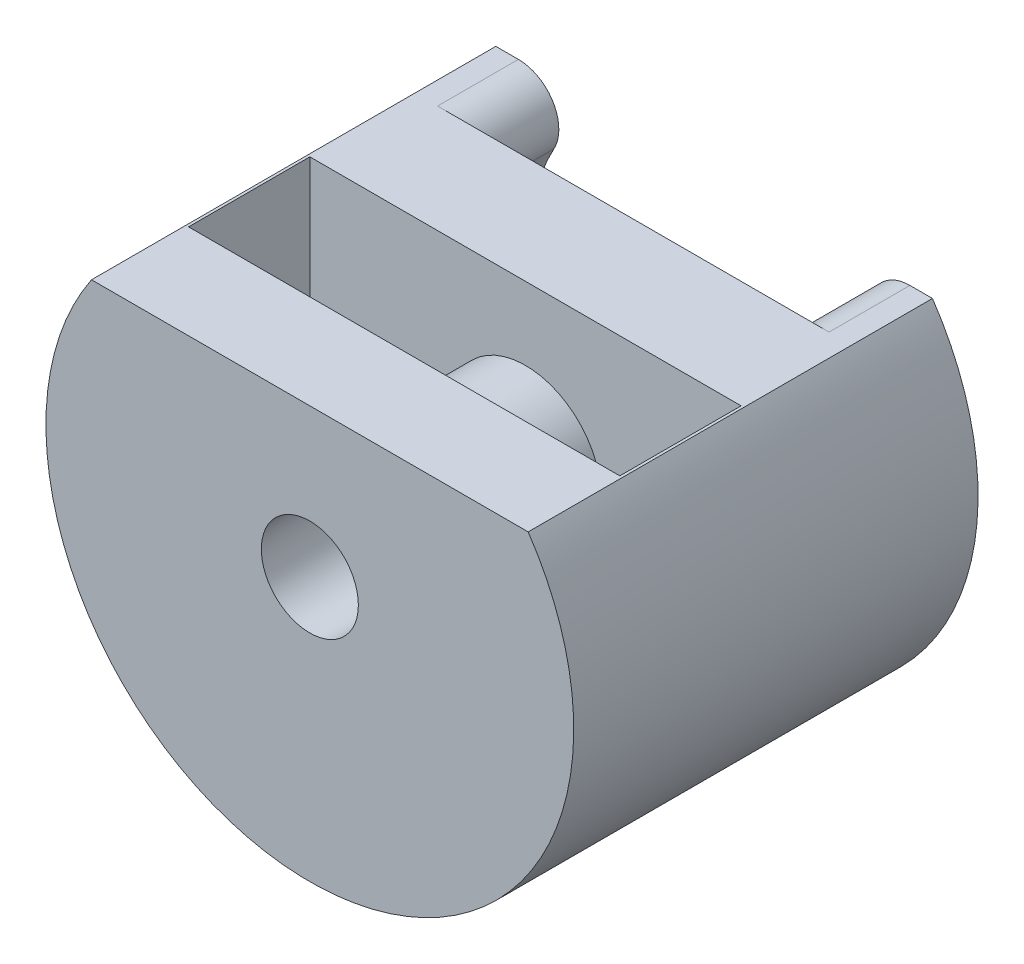
ISO-10303-21;
HEADER;
FILE_DESCRIPTION(('STEP AP214'),'2;1');
FILE_NAME('part.step','',(''),(''),'','','');
FILE_SCHEMA(('AUTOMOTIVE_DESIGN { 1 0 10303 214 1 1 1 1 }'));
ENDSEC;
DATA;
#1=APPLICATION_CONTEXT('core data for automotive mechanical design processes');
#2=APPLICATION_PROTOCOL_DEFINITION('international standard','automotive_design',2000,#1);
#3=PRODUCT_CONTEXT('',#1,'mechanical');
#4=PRODUCT('Part','Part','',(#3));
#5=PRODUCT_RELATED_PRODUCT_CATEGORY('part','',(#4));
#6=PRODUCT_DEFINITION_FORMATION('','',#4);
#7=PRODUCT_DEFINITION_CONTEXT('part definition',#1,'design');
#8=PRODUCT_DEFINITION('design','',#6,#7);
#9=PRODUCT_DEFINITION_SHAPE('','',#8);
#10=(LENGTH_UNIT() NAMED_UNIT(*) SI_UNIT(.MILLI.,.METRE.));
#11=(NAMED_UNIT(*) PLANE_ANGLE_UNIT() SI_UNIT($,.RADIAN.));
#12=(NAMED_UNIT(*) SI_UNIT($,.STERADIAN.) SOLID_ANGLE_UNIT());
#13=UNCERTAINTY_MEASURE_WITH_UNIT(LENGTH_MEASURE(1.E-05),#10,'distance_accuracy_value','');
#14=(GEOMETRIC_REPRESENTATION_CONTEXT(3) GLOBAL_UNCERTAINTY_ASSIGNED_CONTEXT((#13)) GLOBAL_UNIT_ASSIGNED_CONTEXT((#10,
#11,#12)) REPRESENTATION_CONTEXT('',''));
#15=CARTESIAN_POINT('',(0.,0.,0.));
#16=DIRECTION('',(0.,0.,1.));
#17=DIRECTION('',(1.,0.,0.));
#18=AXIS2_PLACEMENT_3D('',#15,#16,#17);
#19=CARTESIAN_POINT('',(16.1,7.10459399028028,8.5));
#20=DIRECTION('',(0.,-1.,0.));
#21=DIRECTION('',(0.,0.,-1.));
#22=AXIS2_PLACEMENT_3D('',#19,#20,#21);
#23=PLANE('',#22);
#24=DIRECTION('',(-1.,0.,0.));
#25=VECTOR('',#24,1.);
#26=CARTESIAN_POINT('',(16.1,7.10459399028028,8.5));
#27=LINE('',#26,#25);
#28=CARTESIAN_POINT('',(5.30195423604308,7.10459399028028,8.5));
#29=VERTEX_POINT('',#28);
#30=CARTESIAN_POINT('',(0.1,7.10459399028028,8.5));
#31=VERTEX_POINT('',#30);
#32=EDGE_CURVE('E152',#29,#31,#27,.T.);
#33=ORIENTED_EDGE('',*,*,#32,.F.);
#34=DIRECTION('',(0.,0.,-1.));
#35=VECTOR('',#34,1.);
#36=CARTESIAN_POINT('',(5.30195423604308,7.10459399028028,19.9195959492893));
#37=LINE('',#36,#35);
#38=CARTESIAN_POINT('',(5.30195423604308,7.10459399028028,9.));
#39=VERTEX_POINT('',#38);
#40=EDGE_CURVE('E139',#29,#39,#37,.F.);
#41=ORIENTED_EDGE('',*,*,#40,.T.);
#42=DIRECTION('',(-1.,0.,0.));
#43=VECTOR('',#42,1.);
#44=CARTESIAN_POINT('',(16.1,7.10459399028028,9.));
#45=LINE('',#44,#43);
#46=CARTESIAN_POINT('',(0.1,7.10459399028028,9.));
#47=VERTEX_POINT('',#46);
#48=EDGE_CURVE('E150',#39,#47,#45,.T.);
#49=ORIENTED_EDGE('',*,*,#48,.T.);
#50=DIRECTION('',(0.,0.,1.));
#51=VECTOR('',#50,1.);
#52=CARTESIAN_POINT('',(0.1,7.10459399028028,8.5));
#53=LINE('',#52,#51);
#54=EDGE_CURVE('E299',#31,#47,#53,.T.);
#55=ORIENTED_EDGE('',*,*,#54,.F.);
#56=EDGE_LOOP('',(#33,#41,#49,#55));
#57=FACE_BOUND('',#56,.T.);
#58=ADVANCED_FACE('F36',(#57),#23,.T.);
#59=CARTESIAN_POINT('',(16.1,12.5,8.5));
#60=DIRECTION('',(0.,0.,-1.));
#61=DIRECTION('',(0.,1.,0.));
#62=AXIS2_PLACEMENT_3D('',#59,#60,#61);
#63=PLANE('',#62);
#64=CARTESIAN_POINT('',(16.1,7.10459399028028,8.5));
#65=VERTEX_POINT('',#64);
#66=CARTESIAN_POINT('',(10.8980457639569,7.10459399028028,8.5));
#67=VERTEX_POINT('',#66);
#68=EDGE_CURVE('E167',#65,#67,#27,.T.);
#69=ORIENTED_EDGE('',*,*,#68,.T.);
#70=CARTESIAN_POINT('',(8.1,7.,8.5));
#71=DIRECTION('',(0.,0.,-1.));
#72=DIRECTION('',(0.,1.,0.));
#73=AXIS2_PLACEMENT_3D('',#70,#71,#72);
#74=CIRCLE('',#73,2.8);
#75=EDGE_CURVE('E154',#67,#29,#74,.F.);
#76=ORIENTED_EDGE('',*,*,#75,.T.);
#77=ORIENTED_EDGE('',*,*,#32,.T.);
#78=DIRECTION('',(0.,-1.,0.));
#79=VECTOR('',#78,1.);
#80=CARTESIAN_POINT('',(0.1,12.5,8.5));
#81=LINE('',#80,#79);
#82=CARTESIAN_POINT('',(0.1,12.5,8.5));
#83=VERTEX_POINT('',#82);
#84=EDGE_CURVE('E296',#83,#31,#81,.T.);
#85=ORIENTED_EDGE('',*,*,#84,.F.);
#86=DIRECTION('',(-1.,0.,0.));
#87=VECTOR('',#86,1.);
#88=CARTESIAN_POINT('',(16.1,12.5,8.5));
#89=LINE('',#88,#87);
#90=CARTESIAN_POINT('',(16.1,12.5,8.5));
#91=VERTEX_POINT('',#90);
#92=EDGE_CURVE('E170',#91,#83,#89,.T.);
#93=ORIENTED_EDGE('',*,*,#92,.F.);
#94=DIRECTION('',(0.,-1.,0.));
#95=VECTOR('',#94,1.);
#96=CARTESIAN_POINT('',(16.1,12.5,8.5));
#97=LINE('',#96,#95);
#98=EDGE_CURVE('E289',#91,#65,#97,.T.);
#99=ORIENTED_EDGE('',*,*,#98,.T.);
#100=EDGE_LOOP('',(#69,#76,#77,#85,#93,#99));
#101=FACE_BOUND('',#100,.T.);
#102=ADVANCED_FACE('F259',(#101),#63,.T.);
#103=CARTESIAN_POINT('',(16.1,7.10459399028028,9.));
#104=VERTEX_POINT('',#103);
#105=CARTESIAN_POINT('',(10.8980457639569,7.10459399028028,9.));
#106=VERTEX_POINT('',#105);
#107=EDGE_CURVE('E160',#104,#106,#45,.T.);
#108=ORIENTED_EDGE('',*,*,#107,.T.);
#109=DIRECTION('',(0.,0.,-1.));
#110=VECTOR('',#109,1.);
#111=CARTESIAN_POINT('',(10.8980457639569,7.10459399028028,19.9195959492893));
#112=LINE('',#111,#110);
#113=EDGE_CURVE('E52',#106,#67,#112,.T.);
#114=ORIENTED_EDGE('',*,*,#113,.T.);
#115=ORIENTED_EDGE('',*,*,#68,.F.);
#116=DIRECTION('',(0.,0.,1.));
#117=VECTOR('',#116,1.);
#118=CARTESIAN_POINT('',(16.1,7.10459399028028,8.5));
#119=LINE('',#118,#117);
#120=EDGE_CURVE('E276',#65,#104,#119,.T.);
#121=ORIENTED_EDGE('',*,*,#120,.T.);
#122=EDGE_LOOP('',(#108,#114,#115,#121));
#123=FACE_BOUND('',#122,.T.);
#124=ADVANCED_FACE('F261',(#123),#23,.T.);
#125=CARTESIAN_POINT('',(16.1,4.85459399028027,9.));
#126=DIRECTION('',(-1.,0.,0.));
#127=DIRECTION('',(0.,0.,1.));
#128=AXIS2_PLACEMENT_3D('',#125,#126,#127);
#129=CYLINDRICAL_SURFACE('',#128,2.25);
#130=ORIENTED_EDGE('',*,*,#48,.F.);
#131=CARTESIAN_POINT('',(5.30195423604308,7.10459399028028,9.));
#132=CARTESIAN_POINT('',(5.30197017490717,7.10460004063508,9.06303981323276));
#133=CARTESIAN_POINT('',(5.3018555911453,7.10194470978192,9.12607653235527));
#134=CARTESIAN_POINT('',(5.30148164104115,7.09135782728213,9.2517020335063));
#135=CARTESIAN_POINT('',(5.30122228164367,7.08342652871661,9.31429083687518));
#136=CARTESIAN_POINT('',(5.30067486927398,7.06232835143866,9.43861961394278));
#137=CARTESIAN_POINT('',(5.30038680035019,7.0491585498187,9.50035909381701));
#138=CARTESIAN_POINT('',(5.30001218256458,7.01768792203813,9.62249996821037));
#139=CARTESIAN_POINT('',(5.29992563240291,6.99938712897428,9.68290137135787));
#140=CARTESIAN_POINT('',(5.30039477416247,6.93693439609236,9.86153880194135));
#141=CARTESIAN_POINT('',(5.30167898064503,6.88522844326994,9.97722948952094));
#142=CARTESIAN_POINT('',(5.30936734325293,6.76320813459917,10.1981602485472));
#143=CARTESIAN_POINT('',(5.31576906573566,6.69290263442434,10.3034052607138));
#144=CARTESIAN_POINT('',(5.33196815718416,6.57633540234759,10.4497958441459));
#145=CARTESIAN_POINT('',(5.33836448200019,6.53611787396624,10.4962396899225));
#146=CARTESIAN_POINT('',(5.35376471919488,6.45226991534252,10.5854560480316));
#147=CARTESIAN_POINT('',(5.36276739104615,6.40864111593659,10.6282302944348));
#148=CARTESIAN_POINT('',(5.38381206892663,6.31848637706269,10.7097393133004));
#149=CARTESIAN_POINT('',(5.39585214643959,6.27196228994382,10.7484766269305));
#150=CARTESIAN_POINT('',(5.42334038209666,6.17661547415002,10.8216415240716));
#151=CARTESIAN_POINT('',(5.43878814908155,6.12779300980499,10.8560696015174));
#152=CARTESIAN_POINT('',(5.48738005252691,5.98847438704405,10.9463234984605));
#153=CARTESIAN_POINT('',(5.52476049703753,5.89606254506303,10.9970702698767));
#154=CARTESIAN_POINT('',(5.6125188990843,5.71043372896469,11.0833979916165));
#155=CARTESIAN_POINT('',(5.66289552853886,5.61721683805562,11.1189804905942));
#156=CARTESIAN_POINT('',(5.77362086820902,5.43842465423409,11.1748616957813));
#157=CARTESIAN_POINT('',(5.833412579534,5.35269459221331,11.1957813029496));
#158=CARTESIAN_POINT('',(5.9633127444907,5.18736723793662,11.2268478552172));
#159=CARTESIAN_POINT('',(6.03342476418021,5.1077720800656,11.2369910666675));
#160=CARTESIAN_POINT('',(6.19100726185545,4.9482447107953,11.2496317978185));
#161=CARTESIAN_POINT('',(6.27954421258488,4.86929343543185,11.251134331809));
#162=CARTESIAN_POINT('',(6.4658033768364,4.7232836480408,11.2473545164712));
#163=CARTESIAN_POINT('',(6.56353268735664,4.65623444228582,11.2420668842531));
#164=CARTESIAN_POINT('',(6.78714528929537,4.52277587502658,11.2266094841925));
#165=CARTESIAN_POINT('',(6.91471164024911,4.45927118023905,11.2156653896287));
#166=CARTESIAN_POINT('',(7.1781005388964,4.35230329006769,11.1939026188085));
#167=CARTESIAN_POINT('',(7.31392669458388,4.30884892514979,11.1830839998543));
#168=CARTESIAN_POINT('',(7.52903292293474,4.25769601508923,11.1694586047839));
#169=CARTESIAN_POINT('',(7.60655133133319,4.24269244404137,11.1652296129619));
#170=CARTESIAN_POINT('',(7.76267424265243,4.21927416382898,11.1584769970347));
#171=CARTESIAN_POINT('',(7.84127881204195,4.21085985973489,11.1559534777735));
#172=CARTESIAN_POINT('',(7.99892382068657,4.2007104991156,11.1528965438149));
#173=CARTESIAN_POINT('',(8.07796408181677,4.19897289029641,11.1523623686553));
#174=CARTESIAN_POINT('',(8.23589292291564,4.20218467733383,11.1533380900722));
#175=CARTESIAN_POINT('',(8.31478150917129,4.20713378976619,11.1548479000121));
#176=CARTESIAN_POINT('',(8.46873145747193,4.22334897876759,11.1596524278111));
#177=CARTESIAN_POINT('',(8.54382192660679,4.23436069144563,11.1628751030972));
#178=CARTESIAN_POINT('',(8.69280283090095,4.26242123941218,11.170722890261));
#179=CARTESIAN_POINT('',(8.76669280971043,4.27947231680632,11.1753485228928));
#180=CARTESIAN_POINT('',(8.98591464523486,4.33953042749809,11.1906524252101));
#181=CARTESIAN_POINT('',(9.12879497332873,4.39144197350765,11.2027575556902));
#182=CARTESIAN_POINT('',(9.40857435258762,4.51967555633335,11.2259087720298));
#183=CARTESIAN_POINT('',(9.54516334812622,4.59668614549172,11.2369119436283));
#184=CARTESIAN_POINT('',(9.73905583142191,4.72852170276571,11.2468949218444));
#185=CARTESIAN_POINT('',(9.80184566980325,4.77517807704992,11.2491357806888));
#186=CARTESIAN_POINT('',(9.92331559416209,4.87358783785127,11.2504585535796));
#187=CARTESIAN_POINT('',(9.98199696357282,4.9253396203621,11.2495414586635));
#188=CARTESIAN_POINT('',(10.1234063374566,5.06101148719845,11.2419985534964));
#189=CARTESIAN_POINT('',(10.2032040297347,5.14791638875962,11.2327090555627));
#190=CARTESIAN_POINT('',(10.3502137181104,5.3296194244174,11.2012103902424));
#191=CARTESIAN_POINT('',(10.4174385283242,5.42440937819582,11.1790144727926));
#192=CARTESIAN_POINT('',(10.5382101669428,5.61859792492536,11.1187670623623));
#193=CARTESIAN_POINT('',(10.5916682665838,5.7180217640682,11.080616678899));
#194=CARTESIAN_POINT('',(10.6838051914998,5.91563735319423,10.9871112929828));
#195=CARTESIAN_POINT('',(10.7224869404215,6.0138293431885,10.9317596978938));
#196=CARTESIAN_POINT('',(10.7829812940065,6.19393716472979,10.8108641375252));
#197=CARTESIAN_POINT('',(10.8061033451332,6.2764951313266,10.7469148462232));
#198=CARTESIAN_POINT('',(10.8431622213135,6.43296048342553,10.606947721647));
#199=CARTESIAN_POINT('',(10.8570976670292,6.50686656850742,10.5309280781756));
#200=CARTESIAN_POINT('',(10.878450155271,6.64595158423883,10.3658676253604));
#201=CARTESIAN_POINT('',(10.8856236695083,6.71073765587264,10.2764659369448));
#202=CARTESIAN_POINT('',(10.8952339178976,6.82663009196225,10.0889176868518));
#203=CARTESIAN_POINT('',(10.8976670975438,6.8777261663309,9.99076462064262));
#204=CARTESIAN_POINT('',(10.9002454761546,6.96931579554691,9.77793130337004));
#205=CARTESIAN_POINT('',(10.9001394232203,7.00825221557817,9.6625778077352));
#206=CARTESIAN_POINT('',(10.8993551687465,7.06698256435811,9.42720906855761));
#207=CARTESIAN_POINT('',(10.8986778207449,7.08680495560188,9.30720103412053));
#208=CARTESIAN_POINT('',(10.8982336911483,7.09943213796539,9.15549243659271));
#209=CARTESIAN_POINT('',(10.898164258323,7.10136882849859,9.12440185041931));
#210=CARTESIAN_POINT('',(10.8980706321662,7.10394811790434,9.06221093858344));
#211=CARTESIAN_POINT('',(10.8980463750704,7.10459254087531,9.03111068871297));
#212=CARTESIAN_POINT('',(10.8980457639569,7.10459399028028,9.));
#213=B_SPLINE_CURVE_WITH_KNOTS('',3,(#131,#132,#133,#134,#135,#136,#137,#138,#139,#140,#141,
#142,#143,#144,#145,#146,#147,#148,#149,#150,#151,#152,#153,#154,#155,#156,#157,#158,#159,#160,
#161,#162,#163,#164,#165,#166,#167,#168,#169,#170,#171,#172,#173,#174,#175,#176,#177,#178,#179,
#180,#181,#182,#183,#184,#185,#186,#187,#188,#189,#190,#191,#192,#193,#194,#195,#196,#197,#198,
#199,#200,#201,#202,#203,#204,#205,#206,#207,#208,#209,#210,#211,#212),.UNSPECIFIED.,.F.,.F.,(4,
2,2,2,2,2,2,2,2,2,2,2,2,2,2,2,2,2,2,2,2,2,2,2,2,2,2,2,2,2,2,2,2,2,2,2,2,2,2,2,4),(0.,
0.189057929586301,0.378106790970439,0.567261283525273,0.756414555993169,1.13465667818927,
1.51271903369033,1.69781054941082,1.88281411266068,2.06770050738013,2.25256569053633,
2.58621461432354,2.91982945598642,3.23828827406499,3.55685739118029,3.91147301852185,
4.26636471138404,4.69344890233822,5.12072100845953,5.3576732621536,5.59464008117377,
5.83151630609536,6.06838249106469,6.29599412141426,6.52369034098264,6.97909300364472,
7.44822102354262,7.68271011758112,7.91712563033229,8.2706403918462,8.62379286860073,
8.97916751499498,9.33447181054616,9.65388034945579,9.9733368355628,10.3039023644293,
10.634715670228,10.998386266544,11.3615144847459,11.4549509711388,11.5482554742917),.UNSPECIFIED.);
#214=EDGE_CURVE('E135',#39,#106,#213,.T.);
#215=ORIENTED_EDGE('',*,*,#214,.T.);
#216=ORIENTED_EDGE('',*,*,#107,.F.);
#217=CARTESIAN_POINT('',(16.1,4.85459399028027,9.));
#218=DIRECTION('',(1.,0.,0.));
#219=DIRECTION('',(0.,0.,-1.));
#220=AXIS2_PLACEMENT_3D('',#217,#218,#219);
#221=CIRCLE('',#220,2.25);
#222=CARTESIAN_POINT('',(16.1,2.60459399028027,9.));
#223=VERTEX_POINT('',#222);
#224=EDGE_CURVE('E278',#104,#223,#221,.T.);
#225=ORIENTED_EDGE('',*,*,#224,.T.);
#226=DIRECTION('',(-1.,0.,0.));
#227=VECTOR('',#226,1.);
#228=CARTESIAN_POINT('',(16.1,2.60459399028027,9.));
#229=LINE('',#228,#227);
#230=CARTESIAN_POINT('',(0.1,2.60459399028027,9.));
#231=VERTEX_POINT('',#230);
#232=EDGE_CURVE('E161',#223,#231,#229,.T.);
#233=ORIENTED_EDGE('',*,*,#232,.T.);
#234=CARTESIAN_POINT('',(0.1,4.85459399028027,9.));
#235=DIRECTION('',(1.,0.,0.));
#236=DIRECTION('',(0.,0.,-1.));
#237=AXIS2_PLACEMENT_3D('',#234,#235,#236);
#238=CIRCLE('',#237,2.25);
#239=EDGE_CURVE('E159',#47,#231,#238,.T.);
#240=ORIENTED_EDGE('',*,*,#239,.F.);
#241=EDGE_LOOP('',(#130,#215,#216,#225,#233,#240));
#242=FACE_BOUND('',#241,.T.);
#243=ADVANCED_FACE('F157',(#242),#129,.F.);
#244=CARTESIAN_POINT('',(16.1,2.60459399028027,4.));
#245=DIRECTION('',(0.,0.,1.));
#246=DIRECTION('',(1.,0.,0.));
#247=AXIS2_PLACEMENT_3D('',#244,#245,#246);
#248=PLANE('',#247);
#249=DIRECTION('',(0.,1.,0.));
#250=VECTOR('',#249,1.);
#251=CARTESIAN_POINT('',(0.1,2.60459399028027,4.));
#252=LINE('',#251,#250);
#253=CARTESIAN_POINT('',(0.1,2.60459399028027,4.));
#254=VERTEX_POINT('',#253);
#255=CARTESIAN_POINT('',(0.1,12.5,4.));
#256=VERTEX_POINT('',#255);
#257=EDGE_CURVE('E304',#254,#256,#252,.T.);
#258=ORIENTED_EDGE('',*,*,#257,.F.);
#259=DIRECTION('',(-1.,0.,0.));
#260=VECTOR('',#259,1.);
#261=CARTESIAN_POINT('',(16.1,2.60459399028027,4.));
#262=LINE('',#261,#260);
#263=CARTESIAN_POINT('',(16.1,2.60459399028027,4.));
#264=VERTEX_POINT('',#263);
#265=EDGE_CURVE('E163',#264,#254,#262,.T.);
#266=ORIENTED_EDGE('',*,*,#265,.F.);
#267=DIRECTION('',(0.,1.,0.));
#268=VECTOR('',#267,1.);
#269=CARTESIAN_POINT('',(16.1,2.60459399028027,4.));
#270=LINE('',#269,#268);
#271=CARTESIAN_POINT('',(16.1,12.5,4.));
#272=VERTEX_POINT('',#271);
#273=EDGE_CURVE('E287',#264,#272,#270,.T.);
#274=ORIENTED_EDGE('',*,*,#273,.T.);
#275=DIRECTION('',(-1.,0.,0.));
#276=VECTOR('',#275,1.);
#277=CARTESIAN_POINT('',(16.1,12.5,4.));
#278=LINE('',#277,#276);
#279=EDGE_CURVE('E60',#272,#256,#278,.T.);
#280=ORIENTED_EDGE('',*,*,#279,.T.);
#281=EDGE_LOOP('',(#258,#266,#274,#280));
#282=FACE_BOUND('',#281,.T.);
#283=CARTESIAN_POINT('',(8.1,7.,4.));
#284=DIRECTION('',(0.,0.,1.));
#285=DIRECTION('',(1.,0.,0.));
#286=AXIS2_PLACEMENT_3D('',#283,#284,#285);
#287=CIRCLE('',#286,2.8);
#288=CARTESIAN_POINT('',(10.9,7.,4.));
#289=VERTEX_POINT('',#288);
#290=EDGE_CURVE('E145',#289,#289,#287,.T.);
#291=ORIENTED_EDGE('',*,*,#290,.F.);
#292=EDGE_LOOP('',(#291));
#293=FACE_BOUND('',#292,.T.);
#294=ADVANCED_FACE('F273',(#282,#293),#248,.T.);
#295=CARTESIAN_POINT('',(8.1,7.,12.));
#296=DIRECTION('',(0.,0.,-1.));
#297=DIRECTION('',(-1.,0.,0.));
#298=AXIS2_PLACEMENT_3D('',#295,#296,#297);
#299=CYLINDRICAL_SURFACE('',#298,1.8);
#300=CARTESIAN_POINT('',(8.1,7.,0.));
#301=DIRECTION('',(0.,0.,1.));
#302=DIRECTION('',(1.,0.,0.));
#303=AXIS2_PLACEMENT_3D('',#300,#301,#302);
#304=CIRCLE('',#303,1.8);
#305=CARTESIAN_POINT('',(9.9,7.,0.));
#306=VERTEX_POINT('',#305);
#307=EDGE_CURVE('E40',#306,#306,#304,.F.);
#308=ORIENTED_EDGE('',*,*,#307,.T.);
#309=EDGE_LOOP('',(#308));
#310=FACE_BOUND('',#309,.T.);
#311=CARTESIAN_POINT('',(8.1,7.,12.));
#312=DIRECTION('',(0.,0.,1.));
#313=DIRECTION('',(1.,0.,0.));
#314=AXIS2_PLACEMENT_3D('',#311,#312,#313);
#315=CIRCLE('',#314,1.8);
#316=CARTESIAN_POINT('',(9.9,7.,12.));
#317=VERTEX_POINT('',#316);
#318=EDGE_CURVE('E203',#317,#317,#315,.T.);
#319=ORIENTED_EDGE('',*,*,#318,.T.);
#320=EDGE_LOOP('',(#319));
#321=FACE_BOUND('',#320,.T.);
#322=ADVANCED_FACE('F336',(#310,#321),#299,.F.);
#323=CARTESIAN_POINT('',(8.1,7.,12.));
#324=DIRECTION('',(0.,0.,-1.));
#325=DIRECTION('',(-1.,0.,0.));
#326=AXIS2_PLACEMENT_3D('',#323,#324,#325);
#327=CYLINDRICAL_SURFACE('',#326,9.79081201943945);
#328=DIRECTION('',(0.,0.,-1.));
#329=VECTOR('',#328,1.);
#330=CARTESIAN_POINT('',(0.,12.5,12.));
#331=LINE('',#330,#329);
#332=CARTESIAN_POINT('',(0.,12.5,12.));
#333=VERTEX_POINT('',#332);
#334=CARTESIAN_POINT('',(0.,12.5,-3.));
#335=VERTEX_POINT('',#334);
#336=EDGE_CURVE('E45',#333,#335,#331,.T.);
#337=ORIENTED_EDGE('',*,*,#336,.T.);
#338=CARTESIAN_POINT('',(8.1,7.,-3.));
#339=DIRECTION('',(0.,0.,1.));
#340=DIRECTION('',(1.,0.,0.));
#341=AXIS2_PLACEMENT_3D('',#338,#339,#340);
#342=CIRCLE('',#341,9.79081201943945);
#343=CARTESIAN_POINT('',(16.2,12.5,-3.));
#344=VERTEX_POINT('',#343);
#345=EDGE_CURVE('E174',#335,#344,#342,.T.);
#346=ORIENTED_EDGE('',*,*,#345,.T.);
#347=DIRECTION('',(0.,0.,-1.));
#348=VECTOR('',#347,1.);
#349=CARTESIAN_POINT('',(16.2,12.5,12.));
#350=LINE('',#349,#348);
#351=CARTESIAN_POINT('',(16.2,12.5,12.));
#352=VERTEX_POINT('',#351);
#353=EDGE_CURVE('E11',#352,#344,#350,.T.);
#354=ORIENTED_EDGE('',*,*,#353,.F.);
#355=CARTESIAN_POINT('',(8.1,7.,12.));
#356=DIRECTION('',(0.,0.,1.));
#357=DIRECTION('',(1.,0.,0.));
#358=AXIS2_PLACEMENT_3D('',#355,#356,#357);
#359=CIRCLE('',#358,9.79081201943945);
#360=EDGE_CURVE('E211',#333,#352,#359,.T.);
#361=ORIENTED_EDGE('',*,*,#360,.F.);
#362=EDGE_LOOP('',(#337,#346,#354,#361));
#363=FACE_BOUND('',#362,.T.);
#364=ADVANCED_FACE('F38',(#363),#327,.T.);
#365=CARTESIAN_POINT('',(0.,12.5,12.));
#366=DIRECTION('',(0.,-1.,0.));
#367=DIRECTION('',(0.,0.,-1.));
#368=AXIS2_PLACEMENT_3D('',#365,#366,#367);
#369=PLANE('',#368);
#370=ORIENTED_EDGE('',*,*,#279,.F.);
#371=DIRECTION('',(0.,0.,1.));
#372=VECTOR('',#371,1.);
#373=CARTESIAN_POINT('',(16.1,12.5,4.));
#374=LINE('',#373,#372);
#375=EDGE_CURVE('E306',#272,#91,#374,.T.);
#376=ORIENTED_EDGE('',*,*,#375,.T.);
#377=ORIENTED_EDGE('',*,*,#92,.T.);
#378=DIRECTION('',(0.,0.,1.));
#379=VECTOR('',#378,1.);
#380=CARTESIAN_POINT('',(0.1,12.5,4.));
#381=LINE('',#380,#379);
#382=EDGE_CURVE('E153',#256,#83,#381,.T.);
#383=ORIENTED_EDGE('',*,*,#382,.F.);
#384=EDGE_LOOP('',(#370,#376,#377,#383));
#385=FACE_BOUND('',#384,.T.);
#386=ORIENTED_EDGE('',*,*,#353,.T.);
#387=DIRECTION('',(-1.,0.,0.));
#388=VECTOR('',#387,1.);
#389=CARTESIAN_POINT('',(16.2,12.5,-3.));
#390=LINE('',#389,#388);
#391=CARTESIAN_POINT('',(15.36206333914,12.5,-3.));
#392=VERTEX_POINT('',#391);
#393=EDGE_CURVE('E177',#344,#392,#390,.T.);
#394=ORIENTED_EDGE('',*,*,#393,.T.);
#395=DIRECTION('',(0.,0.,1.));
#396=VECTOR('',#395,1.);
#397=CARTESIAN_POINT('',(15.36206333914,12.5,-3.));
#398=LINE('',#397,#396);
#399=CARTESIAN_POINT('',(15.36206333914,12.5,0.));
#400=VERTEX_POINT('',#399);
#401=EDGE_CURVE('E193',#392,#400,#398,.T.);
#402=ORIENTED_EDGE('',*,*,#401,.T.);
#403=DIRECTION('',(-1.,0.,0.));
#404=VECTOR('',#403,1.);
#405=CARTESIAN_POINT('',(0.,12.5,0.));
#406=LINE('',#405,#404);
#407=CARTESIAN_POINT('',(0.837936660859968,12.5,0.));
#408=VERTEX_POINT('',#407);
#409=EDGE_CURVE('E215',#400,#408,#406,.T.);
#410=ORIENTED_EDGE('',*,*,#409,.T.);
#411=DIRECTION('',(0.,0.,1.));
#412=VECTOR('',#411,1.);
#413=CARTESIAN_POINT('',(0.837936660859984,12.5,-3.));
#414=LINE('',#413,#412);
#415=CARTESIAN_POINT('',(0.837936660859984,12.5,-3.));
#416=VERTEX_POINT('',#415);
#417=EDGE_CURVE('E201',#416,#408,#414,.T.);
#418=ORIENTED_EDGE('',*,*,#417,.F.);
#419=DIRECTION('',(-1.,0.,0.));
#420=VECTOR('',#419,1.);
#421=CARTESIAN_POINT('',(0.,12.5,-3.));
#422=LINE('',#421,#420);
#423=EDGE_CURVE('E190',#416,#335,#422,.T.);
#424=ORIENTED_EDGE('',*,*,#423,.T.);
#425=ORIENTED_EDGE('',*,*,#336,.F.);
#426=DIRECTION('',(-1.,0.,0.));
#427=VECTOR('',#426,1.);
#428=CARTESIAN_POINT('',(0.,12.5,12.));
#429=LINE('',#428,#427);
#430=EDGE_CURVE('E214',#352,#333,#429,.T.);
#431=ORIENTED_EDGE('',*,*,#430,.F.);
#432=EDGE_LOOP('',(#386,#394,#402,#410,#418,#424,#425,#431));
#433=FACE_BOUND('',#432,.T.);
#434=ADVANCED_FACE('F231',(#385,#433),#369,.F.);
#435=CARTESIAN_POINT('',(8.1,7.,12.));
#436=DIRECTION('',(0.,0.,1.));
#437=DIRECTION('',(1.,0.,0.));
#438=AXIS2_PLACEMENT_3D('',#435,#436,#437);
#439=PLANE('',#438);
#440=ORIENTED_EDGE('',*,*,#318,.F.);
#441=EDGE_LOOP('',(#440));
#442=FACE_BOUND('',#441,.T.);
#443=ORIENTED_EDGE('',*,*,#360,.T.);
#444=ORIENTED_EDGE('',*,*,#430,.T.);
#445=EDGE_LOOP('',(#443,#444));
#446=FACE_BOUND('',#445,.T.);
#447=ADVANCED_FACE('F244',(#442,#446),#439,.T.);
#448=CARTESIAN_POINT('',(8.1,7.,0.));
#449=DIRECTION('',(0.,0.,1.));
#450=DIRECTION('',(1.,0.,0.));
#451=AXIS2_PLACEMENT_3D('',#448,#449,#450);
#452=PLANE('',#451);
#453=ORIENTED_EDGE('',*,*,#307,.F.);
#454=EDGE_LOOP('',(#453));
#455=FACE_BOUND('',#454,.T.);
#456=ORIENTED_EDGE('',*,*,#409,.F.);
#457=CARTESIAN_POINT('',(15.36206333914,11.,0.));
#458=DIRECTION('',(0.,0.,1.));
#459=DIRECTION('',(1.,0.,0.));
#460=AXIS2_PLACEMENT_3D('',#457,#458,#459);
#461=CIRCLE('',#460,1.5);
#462=CARTESIAN_POINT('',(14.0481878124523,10.2763073163483,0.));
#463=VERTEX_POINT('',#462);
#464=EDGE_CURVE('E173',#400,#463,#461,.T.);
#465=ORIENTED_EDGE('',*,*,#464,.T.);
#466=CARTESIAN_POINT('',(8.1,7.,0.));
#467=DIRECTION('',(0.,0.,-1.));
#468=DIRECTION('',(1.,0.,0.));
#469=AXIS2_PLACEMENT_3D('',#466,#467,#468);
#470=CIRCLE('',#469,6.79081201943945);
#471=CARTESIAN_POINT('',(2.15181218754771,10.2763073163483,0.));
#472=VERTEX_POINT('',#471);
#473=EDGE_CURVE('E196',#463,#472,#470,.T.);
#474=ORIENTED_EDGE('',*,*,#473,.T.);
#475=CARTESIAN_POINT('',(0.837936660859968,11.,0.));
#476=DIRECTION('',(0.,0.,1.));
#477=DIRECTION('',(-1.,0.,0.));
#478=AXIS2_PLACEMENT_3D('',#475,#476,#477);
#479=CIRCLE('',#478,1.5);
#480=EDGE_CURVE('E178',#472,#408,#479,.T.);
#481=ORIENTED_EDGE('',*,*,#480,.T.);
#482=EDGE_LOOP('',(#456,#465,#474,#481));
#483=FACE_BOUND('',#482,.T.);
#484=ADVANCED_FACE('F246',(#455,#483),#452,.F.);
#485=CARTESIAN_POINT('',(0.837936660859968,11.,-3.));
#486=DIRECTION('',(0.,0.,1.));
#487=DIRECTION('',(1.,0.,0.));
#488=AXIS2_PLACEMENT_3D('',#485,#486,#487);
#489=CYLINDRICAL_SURFACE('',#488,1.5);
#490=ORIENTED_EDGE('',*,*,#480,.F.);
#491=DIRECTION('',(0.,0.,1.));
#492=VECTOR('',#491,1.);
#493=CARTESIAN_POINT('',(2.15181218754771,10.2763073163483,-3.));
#494=LINE('',#493,#492);
#495=CARTESIAN_POINT('',(2.15181218754771,10.2763073163483,-3.));
#496=VERTEX_POINT('',#495);
#497=EDGE_CURVE('E204',#496,#472,#494,.T.);
#498=ORIENTED_EDGE('',*,*,#497,.F.);
#499=CARTESIAN_POINT('',(0.837936660859968,11.,-3.));
#500=DIRECTION('',(0.,0.,1.));
#501=DIRECTION('',(-1.,0.,0.));
#502=AXIS2_PLACEMENT_3D('',#499,#500,#501);
#503=CIRCLE('',#502,1.5);
#504=EDGE_CURVE('E187',#496,#416,#503,.T.);
#505=ORIENTED_EDGE('',*,*,#504,.T.);
#506=ORIENTED_EDGE('',*,*,#417,.T.);
#507=EDGE_LOOP('',(#490,#498,#505,#506));
#508=FACE_BOUND('',#507,.T.);
#509=ADVANCED_FACE('F235',(#508),#489,.T.);
#510=CARTESIAN_POINT('',(8.1,7.,-3.));
#511=DIRECTION('',(0.,0.,1.));
#512=DIRECTION('',(1.,0.,0.));
#513=AXIS2_PLACEMENT_3D('',#510,#511,#512);
#514=CYLINDRICAL_SURFACE('',#513,6.79081201943945);
#515=ORIENTED_EDGE('',*,*,#473,.F.);
#516=DIRECTION('',(0.,0.,1.));
#517=VECTOR('',#516,1.);
#518=CARTESIAN_POINT('',(14.0481878124523,10.2763073163483,-3.));
#519=LINE('',#518,#517);
#520=CARTESIAN_POINT('',(14.0481878124523,10.2763073163483,-3.));
#521=VERTEX_POINT('',#520);
#522=EDGE_CURVE('E206',#521,#463,#519,.T.);
#523=ORIENTED_EDGE('',*,*,#522,.F.);
#524=CARTESIAN_POINT('',(8.1,7.,-3.));
#525=DIRECTION('',(0.,0.,-1.));
#526=DIRECTION('',(1.,0.,0.));
#527=AXIS2_PLACEMENT_3D('',#524,#525,#526);
#528=CIRCLE('',#527,6.79081201943945);
#529=EDGE_CURVE('E184',#521,#496,#528,.T.);
#530=ORIENTED_EDGE('',*,*,#529,.T.);
#531=ORIENTED_EDGE('',*,*,#497,.T.);
#532=EDGE_LOOP('',(#515,#523,#530,#531));
#533=FACE_BOUND('',#532,.T.);
#534=ADVANCED_FACE('F239',(#533),#514,.F.);
#535=CARTESIAN_POINT('',(15.36206333914,11.,-3.));
#536=DIRECTION('',(0.,0.,1.));
#537=DIRECTION('',(1.,0.,0.));
#538=AXIS2_PLACEMENT_3D('',#535,#536,#537);
#539=CYLINDRICAL_SURFACE('',#538,1.5);
#540=ORIENTED_EDGE('',*,*,#464,.F.);
#541=ORIENTED_EDGE('',*,*,#401,.F.);
#542=CARTESIAN_POINT('',(15.36206333914,11.,-3.));
#543=DIRECTION('',(0.,0.,1.));
#544=DIRECTION('',(1.,0.,0.));
#545=AXIS2_PLACEMENT_3D('',#542,#543,#544);
#546=CIRCLE('',#545,1.5);
#547=EDGE_CURVE('E181',#392,#521,#546,.T.);
#548=ORIENTED_EDGE('',*,*,#547,.T.);
#549=ORIENTED_EDGE('',*,*,#522,.T.);
#550=EDGE_LOOP('',(#540,#541,#548,#549));
#551=FACE_BOUND('',#550,.T.);
#552=ADVANCED_FACE('F242',(#551),#539,.T.);
#553=CARTESIAN_POINT('',(8.1,7.,-3.));
#554=DIRECTION('',(0.,0.,1.));
#555=DIRECTION('',(1.,0.,0.));
#556=AXIS2_PLACEMENT_3D('',#553,#554,#555);
#557=PLANE('',#556);
#558=ORIENTED_EDGE('',*,*,#345,.F.);
#559=ORIENTED_EDGE('',*,*,#423,.F.);
#560=ORIENTED_EDGE('',*,*,#504,.F.);
#561=ORIENTED_EDGE('',*,*,#529,.F.);
#562=ORIENTED_EDGE('',*,*,#547,.F.);
#563=ORIENTED_EDGE('',*,*,#393,.F.);
#564=EDGE_LOOP('',(#558,#559,#560,#561,#562,#563));
#565=FACE_BOUND('',#564,.T.);
#566=ADVANCED_FACE('F228',(#565),#557,.F.);
#567=CARTESIAN_POINT('',(16.1,2.60459399028027,9.));
#568=DIRECTION('',(0.,1.,0.));
#569=DIRECTION('',(0.,0.,1.));
#570=AXIS2_PLACEMENT_3D('',#567,#568,#569);
#571=PLANE('',#570);
#572=DIRECTION('',(0.,0.,-1.));
#573=VECTOR('',#572,1.);
#574=CARTESIAN_POINT('',(0.1,2.60459399028027,9.));
#575=LINE('',#574,#573);
#576=EDGE_CURVE('E302',#231,#254,#575,.T.);
#577=ORIENTED_EDGE('',*,*,#576,.F.);
#578=ORIENTED_EDGE('',*,*,#232,.F.);
#579=DIRECTION('',(0.,0.,-1.));
#580=VECTOR('',#579,1.);
#581=CARTESIAN_POINT('',(16.1,2.60459399028027,9.));
#582=LINE('',#581,#580);
#583=EDGE_CURVE('E285',#223,#264,#582,.T.);
#584=ORIENTED_EDGE('',*,*,#583,.T.);
#585=ORIENTED_EDGE('',*,*,#265,.T.);
#586=EDGE_LOOP('',(#577,#578,#584,#585));
#587=FACE_BOUND('',#586,.T.);
#588=ADVANCED_FACE('F311',(#587),#571,.T.);
#589=CARTESIAN_POINT('',(16.1,4.85459399028027,9.));
#590=DIRECTION('',(1.,0.,0.));
#591=DIRECTION('',(0.,0.,-1.));
#592=AXIS2_PLACEMENT_3D('',#589,#590,#591);
#593=PLANE('',#592);
#594=ORIENTED_EDGE('',*,*,#375,.F.);
#595=ORIENTED_EDGE('',*,*,#273,.F.);
#596=ORIENTED_EDGE('',*,*,#583,.F.);
#597=ORIENTED_EDGE('',*,*,#224,.F.);
#598=ORIENTED_EDGE('',*,*,#120,.F.);
#599=ORIENTED_EDGE('',*,*,#98,.F.);
#600=EDGE_LOOP('',(#594,#595,#596,#597,#598,#599));
#601=FACE_BOUND('',#600,.T.);
#602=ADVANCED_FACE('F283',(#601),#593,.F.);
#603=CARTESIAN_POINT('',(0.1,4.85459399028027,9.));
#604=DIRECTION('',(1.,0.,0.));
#605=DIRECTION('',(0.,0.,-1.));
#606=AXIS2_PLACEMENT_3D('',#603,#604,#605);
#607=PLANE('',#606);
#608=ORIENTED_EDGE('',*,*,#382,.T.);
#609=ORIENTED_EDGE('',*,*,#84,.T.);
#610=ORIENTED_EDGE('',*,*,#54,.T.);
#611=ORIENTED_EDGE('',*,*,#239,.T.);
#612=ORIENTED_EDGE('',*,*,#576,.T.);
#613=ORIENTED_EDGE('',*,*,#257,.T.);
#614=EDGE_LOOP('',(#608,#609,#610,#611,#612,#613));
#615=FACE_BOUND('',#614,.T.);
#616=ADVANCED_FACE('F315',(#615),#607,.T.);
#617=CARTESIAN_POINT('',(8.1,7.,19.9195959492893));
#618=DIRECTION('',(0.,0.,-1.));
#619=DIRECTION('',(-1.,0.,0.));
#620=AXIS2_PLACEMENT_3D('',#617,#618,#619);
#621=CYLINDRICAL_SURFACE('',#620,2.8);
#622=ORIENTED_EDGE('',*,*,#40,.F.);
#623=ORIENTED_EDGE('',*,*,#75,.F.);
#624=ORIENTED_EDGE('',*,*,#113,.F.);
#625=ORIENTED_EDGE('',*,*,#214,.F.);
#626=EDGE_LOOP('',(#622,#623,#624,#625));
#627=FACE_BOUND('',#626,.T.);
#628=ORIENTED_EDGE('',*,*,#290,.T.);
#629=EDGE_LOOP('',(#628));
#630=FACE_BOUND('',#629,.T.);
#631=ADVANCED_FACE('F137',(#627,#630),#621,.T.);
#632=CLOSED_SHELL('',(#58,#102,#124,#243,#294,#322,#364,#434,#447,#484,#509,#534,#552,#566,#588,
#602,#616,#631));
#633=MANIFOLD_SOLID_BREP('B2',#632);
#634=ADVANCED_BREP_SHAPE_REPRESENTATION('',(#18,#633),#14);
#635=SHAPE_DEFINITION_REPRESENTATION(#9,#634);
ENDSEC;
END-ISO-10303-21;
